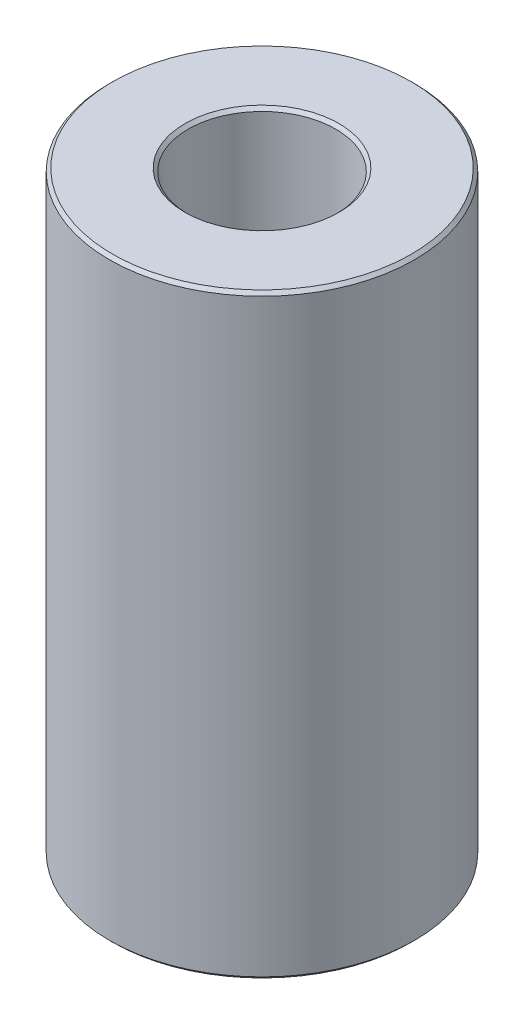
ISO-10303-21;
HEADER;
FILE_DESCRIPTION(('STEP AP214'),'2;1');
FILE_NAME('part.step','',(''),(''),'','','');
FILE_SCHEMA(('AUTOMOTIVE_DESIGN { 1 0 10303 214 1 1 1 1 }'));
ENDSEC;
DATA;
#1=APPLICATION_CONTEXT('core data for automotive mechanical design processes');
#2=APPLICATION_PROTOCOL_DEFINITION('international standard','automotive_design',2000,#1);
#3=PRODUCT_CONTEXT('',#1,'mechanical');
#4=PRODUCT('Part','Part','',(#3));
#5=PRODUCT_RELATED_PRODUCT_CATEGORY('part','',(#4));
#6=PRODUCT_DEFINITION_FORMATION('','',#4);
#7=PRODUCT_DEFINITION_CONTEXT('part definition',#1,'design');
#8=PRODUCT_DEFINITION('design','',#6,#7);
#9=PRODUCT_DEFINITION_SHAPE('','',#8);
#10=(LENGTH_UNIT() NAMED_UNIT(*) SI_UNIT(.MILLI.,.METRE.));
#11=(NAMED_UNIT(*) PLANE_ANGLE_UNIT() SI_UNIT($,.RADIAN.));
#12=(NAMED_UNIT(*) SI_UNIT($,.STERADIAN.) SOLID_ANGLE_UNIT());
#13=UNCERTAINTY_MEASURE_WITH_UNIT(LENGTH_MEASURE(1.E-05),#10,'distance_accuracy_value','');
#14=(GEOMETRIC_REPRESENTATION_CONTEXT(3) GLOBAL_UNCERTAINTY_ASSIGNED_CONTEXT((#13)) GLOBAL_UNIT_ASSIGNED_CONTEXT((#10,
#11,#12)) REPRESENTATION_CONTEXT('',''));
#15=CARTESIAN_POINT('',(0.,0.,0.));
#16=DIRECTION('',(0.,0.,1.));
#17=DIRECTION('',(1.,0.,0.));
#18=AXIS2_PLACEMENT_3D('',#15,#16,#17);
#19=CARTESIAN_POINT('',(0.,175.735483214628,0.));
#20=DIRECTION('',(0.,-1.,0.));
#21=DIRECTION('',(0.,0.,-1.));
#22=AXIS2_PLACEMENT_3D('',#19,#20,#21);
#23=CYLINDRICAL_SURFACE('',#22,45.);
#24=CARTESIAN_POINT('',(0.,0.946063948156578,0.));
#25=DIRECTION('',(0.,1.,0.));
#26=DIRECTION('',(0.,0.,1.));
#27=AXIS2_PLACEMENT_3D('',#24,#25,#26);
#28=CIRCLE('',#27,45.);
#29=CARTESIAN_POINT('',(0.,0.946063948156578,45.));
#30=VERTEX_POINT('',#29);
#31=EDGE_CURVE('E10',#30,#30,#28,.T.);
#32=ORIENTED_EDGE('',*,*,#31,.T.);
#33=EDGE_LOOP('',(#32));
#34=FACE_BOUND('',#33,.T.);
#35=CARTESIAN_POINT('',(0.,174.789419266472,0.));
#36=DIRECTION('',(0.,1.,0.));
#37=DIRECTION('',(0.,0.,1.));
#38=AXIS2_PLACEMENT_3D('',#35,#36,#37);
#39=CIRCLE('',#38,45.);
#40=CARTESIAN_POINT('',(0.,174.789419266472,-45.));
#41=VERTEX_POINT('',#40);
#42=EDGE_CURVE('E50',#41,#41,#39,.F.);
#43=ORIENTED_EDGE('',*,*,#42,.T.);
#44=EDGE_LOOP('',(#43));
#45=FACE_BOUND('',#44,.T.);
#46=ADVANCED_FACE('F39',(#34,#45),#23,.T.);
#47=CARTESIAN_POINT('',(0.,175.735483214628,0.));
#48=DIRECTION('',(0.,1.,0.));
#49=DIRECTION('',(0.,0.,1.));
#50=AXIS2_PLACEMENT_3D('',#47,#48,#49);
#51=PLANE('',#50);
#52=CARTESIAN_POINT('',(0.,175.735483214628,0.));
#53=DIRECTION('',(0.,1.,0.));
#54=DIRECTION('',(0.,0.,1.));
#55=AXIS2_PLACEMENT_3D('',#52,#53,#54);
#56=CIRCLE('',#55,22.7069966167582);
#57=CARTESIAN_POINT('',(0.,175.735483214628,22.7069966167581));
#58=VERTEX_POINT('',#57);
#59=EDGE_CURVE('E58',#58,#58,#56,.F.);
#60=ORIENTED_EDGE('',*,*,#59,.T.);
#61=EDGE_LOOP('',(#60));
#62=FACE_BOUND('',#61,.T.);
#63=CARTESIAN_POINT('',(0.,175.735483214628,0.));
#64=DIRECTION('',(0.,1.,0.));
#65=DIRECTION('',(0.,0.,1.));
#66=AXIS2_PLACEMENT_3D('',#63,#64,#65);
#67=CIRCLE('',#66,44.0539360518435);
#68=CARTESIAN_POINT('',(0.,175.735483214628,-44.0539360518435));
#69=VERTEX_POINT('',#68);
#70=EDGE_CURVE('E61',#69,#69,#67,.T.);
#71=ORIENTED_EDGE('',*,*,#70,.T.);
#72=EDGE_LOOP('',(#71));
#73=FACE_BOUND('',#72,.T.);
#74=ADVANCED_FACE('F88',(#62,#73),#51,.T.);
#75=CARTESIAN_POINT('',(0.,0.,0.));
#76=DIRECTION('',(0.,1.,0.));
#77=DIRECTION('',(0.,0.,1.));
#78=AXIS2_PLACEMENT_3D('',#75,#76,#77);
#79=PLANE('',#78);
#80=CARTESIAN_POINT('',(0.,0.,0.));
#81=DIRECTION('',(0.,1.,0.));
#82=DIRECTION('',(0.,0.,1.));
#83=AXIS2_PLACEMENT_3D('',#80,#81,#82);
#84=CIRCLE('',#83,22.7069966167582);
#85=CARTESIAN_POINT('',(0.,0.,22.7069966167582));
#86=VERTEX_POINT('',#85);
#87=EDGE_CURVE('E51',#86,#86,#84,.T.);
#88=ORIENTED_EDGE('',*,*,#87,.T.);
#89=EDGE_LOOP('',(#88));
#90=FACE_BOUND('',#89,.T.);
#91=CARTESIAN_POINT('',(0.,0.,0.));
#92=DIRECTION('',(0.,1.,0.));
#93=DIRECTION('',(0.,0.,1.));
#94=AXIS2_PLACEMENT_3D('',#91,#92,#93);
#95=CIRCLE('',#94,44.0539360518434);
#96=CARTESIAN_POINT('',(0.,0.,44.0539360518434));
#97=VERTEX_POINT('',#96);
#98=EDGE_CURVE('E54',#97,#97,#95,.F.);
#99=ORIENTED_EDGE('',*,*,#98,.T.);
#100=EDGE_LOOP('',(#99));
#101=FACE_BOUND('',#100,.T.);
#102=ADVANCED_FACE('F83',(#90,#101),#79,.F.);
#103=CARTESIAN_POINT('',(0.,175.735483214628,0.));
#104=DIRECTION('',(0.,-1.,0.));
#105=DIRECTION('',(0.,0.,-1.));
#106=AXIS2_PLACEMENT_3D('',#103,#104,#105);
#107=CYLINDRICAL_SURFACE('',#106,21.7609326686016);
#108=CARTESIAN_POINT('',(0.,174.789419266472,0.));
#109=DIRECTION('',(0.,1.,0.));
#110=DIRECTION('',(0.,0.,1.));
#111=AXIS2_PLACEMENT_3D('',#108,#109,#110);
#112=CIRCLE('',#111,21.7609326686016);
#113=CARTESIAN_POINT('',(0.,174.789419266472,21.7609326686016));
#114=VERTEX_POINT('',#113);
#115=EDGE_CURVE('E67',#114,#114,#112,.T.);
#116=ORIENTED_EDGE('',*,*,#115,.T.);
#117=EDGE_LOOP('',(#116));
#118=FACE_BOUND('',#117,.T.);
#119=CARTESIAN_POINT('',(0.,0.94606394815655,0.));
#120=DIRECTION('',(0.,1.,0.));
#121=DIRECTION('',(0.,0.,1.));
#122=AXIS2_PLACEMENT_3D('',#119,#120,#121);
#123=CIRCLE('',#122,21.7609326686016);
#124=CARTESIAN_POINT('',(0.,0.94606394815655,21.7609326686016));
#125=VERTEX_POINT('',#124);
#126=EDGE_CURVE('E69',#125,#125,#123,.F.);
#127=ORIENTED_EDGE('',*,*,#126,.T.);
#128=EDGE_LOOP('',(#127));
#129=FACE_BOUND('',#128,.T.);
#130=ADVANCED_FACE('F71',(#118,#129),#107,.F.);
#131=CARTESIAN_POINT('',(0.,174.789419266472,0.));
#132=DIRECTION('',(0.,1.,0.));
#133=DIRECTION('',(0.,0.,1.));
#134=AXIS2_PLACEMENT_3D('',#131,#132,#133);
#135=CONICAL_SURFACE('',#134,21.7609326686016,0.785398163397452);
#136=CARTESIAN_POINT('',(0.,175.735483214628,22.7069966167581));
#137=CARTESIAN_POINT('',(0.,175.725628381835,22.6971417839648));
#138=CARTESIAN_POINT('',(0.,175.715773549042,22.6872869511715));
#139=CARTESIAN_POINT('',(0.,175.696063883455,22.667577285585));
#140=CARTESIAN_POINT('',(0.,175.686209050662,22.6577224527917));
#141=CARTESIAN_POINT('',(0.,175.666499385075,22.6380127872051));
#142=CARTESIAN_POINT('',(0.,175.656644552282,22.6281579544118));
#143=CARTESIAN_POINT('',(0.,175.636934886695,22.6084482888252));
#144=CARTESIAN_POINT('',(0.,175.627080053902,22.5985934560319));
#145=CARTESIAN_POINT('',(0.,175.607370388315,22.5788837904453));
#146=CARTESIAN_POINT('',(0.,175.597515555522,22.569028957652));
#147=CARTESIAN_POINT('',(0.,175.577805889936,22.5493192920654));
#148=CARTESIAN_POINT('',(0.,175.567951057142,22.5394644592721));
#149=CARTESIAN_POINT('',(0.,175.548241391556,22.5197547936855));
#150=CARTESIAN_POINT('',(0.,175.538386558762,22.5098999608922));
#151=CARTESIAN_POINT('',(0.,175.518676893176,22.4901902953056));
#152=CARTESIAN_POINT('',(0.,175.508822060382,22.4803354625123));
#153=CARTESIAN_POINT('',(0.,175.489112394796,22.4606257969257));
#154=CARTESIAN_POINT('',(0.,175.479257562003,22.4507709641324));
#155=CARTESIAN_POINT('',(0.,175.459547896416,22.4310612985458));
#156=CARTESIAN_POINT('',(0.,175.449693063623,22.4212064657525));
#157=CARTESIAN_POINT('',(0.,175.429983398036,22.4014968001659));
#158=CARTESIAN_POINT('',(0.,175.420128565243,22.3916419673726));
#159=CARTESIAN_POINT('',(0.,175.400418899656,22.371932301786));
#160=CARTESIAN_POINT('',(0.,175.390564066863,22.3620774689927));
#161=CARTESIAN_POINT('',(0.,175.370854401276,22.3423678034061));
#162=CARTESIAN_POINT('',(0.,175.360999568483,22.3325129706128));
#163=CARTESIAN_POINT('',(0.,175.341289902896,22.3128033050262));
#164=CARTESIAN_POINT('',(0.,175.331435070103,22.302948472233));
#165=CARTESIAN_POINT('',(0.,175.311725404516,22.2832388066464));
#166=CARTESIAN_POINT('',(0.,175.301870571723,22.2733839738531));
#167=CARTESIAN_POINT('',(0.,175.282160906137,22.2536743082665));
#168=CARTESIAN_POINT('',(0.,175.272306073343,22.2438194754732));
#169=CARTESIAN_POINT('',(0.,175.252596407757,22.2241098098866));
#170=CARTESIAN_POINT('',(0.,175.242741574963,22.2142549770933));
#171=CARTESIAN_POINT('',(0.,175.223031909377,22.1945453115067));
#172=CARTESIAN_POINT('',(0.,175.213177076584,22.1846904787134));
#173=CARTESIAN_POINT('',(0.,175.193467410997,22.1649808131268));
#174=CARTESIAN_POINT('',(0.,175.183612578204,22.1551259803335));
#175=CARTESIAN_POINT('',(0.,175.163902912617,22.1354163147469));
#176=CARTESIAN_POINT('',(0.,175.154048079824,22.1255614819536));
#177=CARTESIAN_POINT('',(0.,175.134338414237,22.105851816367));
#178=CARTESIAN_POINT('',(0.,175.124483581444,22.0959969835737));
#179=CARTESIAN_POINT('',(0.,175.104773915857,22.0762873179871));
#180=CARTESIAN_POINT('',(0.,175.094919083064,22.0664324851938));
#181=CARTESIAN_POINT('',(0.,175.075209417477,22.0467228196072));
#182=CARTESIAN_POINT('',(0.,175.065354584684,22.0368679868139));
#183=CARTESIAN_POINT('',(0.,175.045644919097,22.0171583212273));
#184=CARTESIAN_POINT('',(0.,175.035790086304,22.007303488434));
#185=CARTESIAN_POINT('',(0.,175.016080420718,21.9875938228474));
#186=CARTESIAN_POINT('',(0.,175.006225587924,21.9777389900541));
#187=CARTESIAN_POINT('',(0.,174.986515922338,21.9580293244675));
#188=CARTESIAN_POINT('',(0.,174.976661089544,21.9481744916743));
#189=CARTESIAN_POINT('',(0.,174.956951423958,21.9284648260877));
#190=CARTESIAN_POINT('',(0.,174.947096591164,21.9186099932944));
#191=CARTESIAN_POINT('',(0.,174.927386925578,21.8989003277078));
#192=CARTESIAN_POINT('',(0.,174.917532092785,21.8890454949145));
#193=CARTESIAN_POINT('',(0.,174.897822427198,21.8693358293279));
#194=CARTESIAN_POINT('',(0.,174.887967594405,21.8594809965346));
#195=CARTESIAN_POINT('',(0.,174.868257928818,21.839771330948));
#196=CARTESIAN_POINT('',(0.,174.858403096025,21.8299164981547));
#197=CARTESIAN_POINT('',(0.,174.838693430438,21.8102068325681));
#198=CARTESIAN_POINT('',(0.,174.828838597645,21.8003519997748));
#199=CARTESIAN_POINT('',(0.,174.809128932058,21.7806423341882));
#200=CARTESIAN_POINT('',(0.,174.799274099265,21.7707875013949));
#201=CARTESIAN_POINT('',(0.,174.789419266472,21.7609326686016));
#202=B_SPLINE_CURVE_WITH_KNOTS('',3,(#136,#137,#138,#139,#140,#141,#142,#143,#144,#145,#146,
#147,#148,#149,#150,#151,#152,#153,#154,#155,#156,#157,#158,#159,#160,#161,#162,#163,#164,#165,
#166,#167,#168,#169,#170,#171,#172,#173,#174,#175,#176,#177,#178,#179,#180,#181,#182,#183,#184,
#185,#186,#187,#188,#189,#190,#191,#192,#193,#194,#195,#196,#197,#198,#199,#200,#201),
.UNSPECIFIED.,.F.,.F.,(4,2,2,2,2,2,2,2,2,2,2,2,2,2,2,2,2,2,2,2,2,2,2,2,2,2,2,2,2,2,2,2,4),(0.,
0.0418105145735887,0.083621029147197,0.125431543720783,0.167242058294392,0.20905257286798,
0.250863087441589,0.292673602015197,0.334484116588783,0.376294631162391,0.41810514573598,
0.459915660309588,0.501726174883197,0.543536689456785,0.585347204030391,0.62715771860398,
0.668968233177588,0.710778747751196,0.752589262324785,0.794399776898391,0.83621029147198,
0.878020806045588,0.919831320619196,0.961641835192785,1.00345234976639,1.04526286433998,
1.08707337891359,1.1288838934872,1.17069440806078,1.21250492263439,1.25431543720798,
1.29612595178159,1.33793646635518),.UNSPECIFIED.);
#203=EDGE_CURVE('BSEAM77',#58,#114,#202,.T.);
#204=ORIENTED_EDGE('',*,*,#59,.F.);
#205=ORIENTED_EDGE('',*,*,#115,.F.);
#206=ORIENTED_EDGE('',*,*,#203,.T.);
#207=ORIENTED_EDGE('',*,*,#203,.F.);
#208=EDGE_LOOP('',(#204,#206,#205,#207));
#209=FACE_BOUND('',#208,.T.);
#210=ADVANCED_FACE('F77',(#209),#135,.F.);
#211=CARTESIAN_POINT('',(0.,0.,0.));
#212=DIRECTION('',(0.,-1.,0.));
#213=DIRECTION('',(0.,0.,-1.));
#214=AXIS2_PLACEMENT_3D('',#211,#212,#213);
#215=CONICAL_SURFACE('',#214,22.7069966167582,0.785398163397452);
#216=ORIENTED_EDGE('',*,*,#126,.F.);
#217=EDGE_LOOP('',(#216));
#218=FACE_BOUND('',#217,.T.);
#219=ORIENTED_EDGE('',*,*,#87,.F.);
#220=EDGE_LOOP('',(#219));
#221=FACE_BOUND('',#220,.T.);
#222=ADVANCED_FACE('F73',(#218,#221),#215,.F.);
#223=CARTESIAN_POINT('',(0.,0.946063948156578,0.));
#224=DIRECTION('',(0.,1.,0.));
#225=DIRECTION('',(0.,0.,1.));
#226=AXIS2_PLACEMENT_3D('',#223,#224,#225);
#227=CONICAL_SURFACE('',#226,45.,0.785398163397456);
#228=ORIENTED_EDGE('',*,*,#98,.F.);
#229=EDGE_LOOP('',(#228));
#230=FACE_BOUND('',#229,.T.);
#231=ORIENTED_EDGE('',*,*,#31,.F.);
#232=EDGE_LOOP('',(#231));
#233=FACE_BOUND('',#232,.T.);
#234=ADVANCED_FACE('F76',(#230,#233),#227,.T.);
#235=CARTESIAN_POINT('',(0.,175.735483214628,0.));
#236=DIRECTION('',(0.,-1.,0.));
#237=DIRECTION('',(0.,0.,-1.));
#238=AXIS2_PLACEMENT_3D('',#235,#236,#237);
#239=CONICAL_SURFACE('',#238,44.0539360518435,0.785398163397445);
#240=CARTESIAN_POINT('',(0.,174.789419266472,-45.));
#241=CARTESIAN_POINT('',(0.,174.799274099265,-44.9901451672067));
#242=CARTESIAN_POINT('',(0.,174.809128932058,-44.9802903344134));
#243=CARTESIAN_POINT('',(0.,174.828838597645,-44.9605806688268));
#244=CARTESIAN_POINT('',(0.,174.838693430438,-44.9507258360335));
#245=CARTESIAN_POINT('',(0.,174.858403096025,-44.9310161704469));
#246=CARTESIAN_POINT('',(0.,174.868257928818,-44.9211613376536));
#247=CARTESIAN_POINT('',(0.,174.887967594405,-44.901451672067));
#248=CARTESIAN_POINT('',(0.,174.897822427198,-44.8915968392738));
#249=CARTESIAN_POINT('',(0.,174.917532092785,-44.8718871736872));
#250=CARTESIAN_POINT('',(0.,174.927386925578,-44.8620323408939));
#251=CARTESIAN_POINT('',(0.,174.947096591164,-44.8423226753073));
#252=CARTESIAN_POINT('',(0.,174.956951423958,-44.832467842514));
#253=CARTESIAN_POINT('',(0.,174.976661089544,-44.8127581769274));
#254=CARTESIAN_POINT('',(0.,174.986515922338,-44.8029033441341));
#255=CARTESIAN_POINT('',(0.,175.006225587924,-44.7831936785475));
#256=CARTESIAN_POINT('',(0.,175.016080420718,-44.7733388457542));
#257=CARTESIAN_POINT('',(0.,175.035790086304,-44.7536291801676));
#258=CARTESIAN_POINT('',(0.,175.045644919097,-44.7437743473743));
#259=CARTESIAN_POINT('',(0.,175.065354584684,-44.7240646817877));
#260=CARTESIAN_POINT('',(0.,175.075209417477,-44.7142098489944));
#261=CARTESIAN_POINT('',(0.,175.094919083064,-44.6945001834078));
#262=CARTESIAN_POINT('',(0.,175.104773915857,-44.6846453506145));
#263=CARTESIAN_POINT('',(0.,175.124483581444,-44.6649356850279));
#264=CARTESIAN_POINT('',(0.,175.134338414237,-44.6550808522346));
#265=CARTESIAN_POINT('',(0.,175.154048079824,-44.635371186648));
#266=CARTESIAN_POINT('',(0.,175.163902912617,-44.6255163538547));
#267=CARTESIAN_POINT('',(0.,175.183612578204,-44.6058066882681));
#268=CARTESIAN_POINT('',(0.,175.193467410997,-44.5959518554748));
#269=CARTESIAN_POINT('',(0.,175.213177076584,-44.5762421898882));
#270=CARTESIAN_POINT('',(0.,175.223031909377,-44.566387357095));
#271=CARTESIAN_POINT('',(0.,175.242741574963,-44.5466776915084));
#272=CARTESIAN_POINT('',(0.,175.252596407757,-44.5368228587151));
#273=CARTESIAN_POINT('',(0.,175.272306073343,-44.5171131931285));
#274=CARTESIAN_POINT('',(0.,175.282160906137,-44.5072583603352));
#275=CARTESIAN_POINT('',(0.,175.301870571723,-44.4875486947486));
#276=CARTESIAN_POINT('',(0.,175.311725404516,-44.4776938619553));
#277=CARTESIAN_POINT('',(0.,175.331435070103,-44.4579841963687));
#278=CARTESIAN_POINT('',(0.,175.341289902896,-44.4481293635754));
#279=CARTESIAN_POINT('',(0.,175.360999568483,-44.4284196979888));
#280=CARTESIAN_POINT('',(0.,175.370854401276,-44.4185648651955));
#281=CARTESIAN_POINT('',(0.,175.390564066863,-44.3988551996089));
#282=CARTESIAN_POINT('',(0.,175.400418899656,-44.3890003668156));
#283=CARTESIAN_POINT('',(0.,175.420128565243,-44.369290701229));
#284=CARTESIAN_POINT('',(0.,175.429983398036,-44.3594358684357));
#285=CARTESIAN_POINT('',(0.,175.449693063623,-44.3397262028491));
#286=CARTESIAN_POINT('',(0.,175.459547896416,-44.3298713700558));
#287=CARTESIAN_POINT('',(0.,175.479257562003,-44.3101617044692));
#288=CARTESIAN_POINT('',(0.,175.489112394796,-44.3003068716759));
#289=CARTESIAN_POINT('',(0.,175.508822060382,-44.2805972060893));
#290=CARTESIAN_POINT('',(0.,175.518676893176,-44.270742373296));
#291=CARTESIAN_POINT('',(0.,175.538386558762,-44.2510327077094));
#292=CARTESIAN_POINT('',(0.,175.548241391556,-44.2411778749161));
#293=CARTESIAN_POINT('',(0.,175.567951057142,-44.2214682093296));
#294=CARTESIAN_POINT('',(0.,175.577805889936,-44.2116133765363));
#295=CARTESIAN_POINT('',(0.,175.597515555522,-44.1919037109497));
#296=CARTESIAN_POINT('',(0.,175.607370388315,-44.1820488781564));
#297=CARTESIAN_POINT('',(0.,175.627080053902,-44.1623392125698));
#298=CARTESIAN_POINT('',(0.,175.636934886695,-44.1524843797765));
#299=CARTESIAN_POINT('',(0.,175.656644552282,-44.1327747141899));
#300=CARTESIAN_POINT('',(0.,175.666499385075,-44.1229198813966));
#301=CARTESIAN_POINT('',(0.,175.686209050662,-44.10321021581));
#302=CARTESIAN_POINT('',(0.,175.696063883455,-44.0933553830167));
#303=CARTESIAN_POINT('',(0.,175.715773549042,-44.0736457174301));
#304=CARTESIAN_POINT('',(0.,175.725628381835,-44.0637908846368));
#305=CARTESIAN_POINT('',(0.,175.735483214628,-44.0539360518435));
#306=B_SPLINE_CURVE_WITH_KNOTS('',3,(#240,#241,#242,#243,#244,#245,#246,#247,#248,#249,#250,
#251,#252,#253,#254,#255,#256,#257,#258,#259,#260,#261,#262,#263,#264,#265,#266,#267,#268,#269,
#270,#271,#272,#273,#274,#275,#276,#277,#278,#279,#280,#281,#282,#283,#284,#285,#286,#287,#288,
#289,#290,#291,#292,#293,#294,#295,#296,#297,#298,#299,#300,#301,#302,#303,#304,#305),
.UNSPECIFIED.,.F.,.F.,(4,2,2,2,2,2,2,2,2,2,2,2,2,2,2,2,2,2,2,2,2,2,2,2,2,2,2,2,2,2,2,2,4),(0.,
0.0418105145735862,0.083621029147197,0.125431543720783,0.167242058294389,0.20905257286798,
0.250863087441586,0.292673602015192,0.334484116588783,0.376294631162389,0.418105145735975,
0.459915660309586,0.501726174883192,0.543536689456778,0.585347204030389,0.627157718603975,
0.668968233177581,0.710778747751192,0.752589262324778,0.794399776898388,0.836210291471975,
0.87802080604558,0.919831320619191,0.961641835192777,1.00345234976638,1.04526286433997,
1.08707337891358,1.12888389348719,1.17069440806078,1.21250492263438,1.25431543720797,
1.29612595178158,1.33793646635519),.UNSPECIFIED.);
#307=EDGE_CURVE('BSEAM45',#41,#69,#306,.T.);
#308=ORIENTED_EDGE('',*,*,#42,.F.);
#309=ORIENTED_EDGE('',*,*,#70,.F.);
#310=ORIENTED_EDGE('',*,*,#307,.T.);
#311=ORIENTED_EDGE('',*,*,#307,.F.);
#312=EDGE_LOOP('',(#308,#310,#309,#311));
#313=FACE_BOUND('',#312,.T.);
#314=ADVANCED_FACE('F45',(#313),#239,.T.);
#315=CLOSED_SHELL('',(#46,#74,#102,#130,#210,#222,#234,#314));
#316=MANIFOLD_SOLID_BREP('B2',#315);
#317=ADVANCED_BREP_SHAPE_REPRESENTATION('',(#18,#316),#14);
#318=SHAPE_DEFINITION_REPRESENTATION(#9,#317);
ENDSEC;
END-ISO-10303-21;
